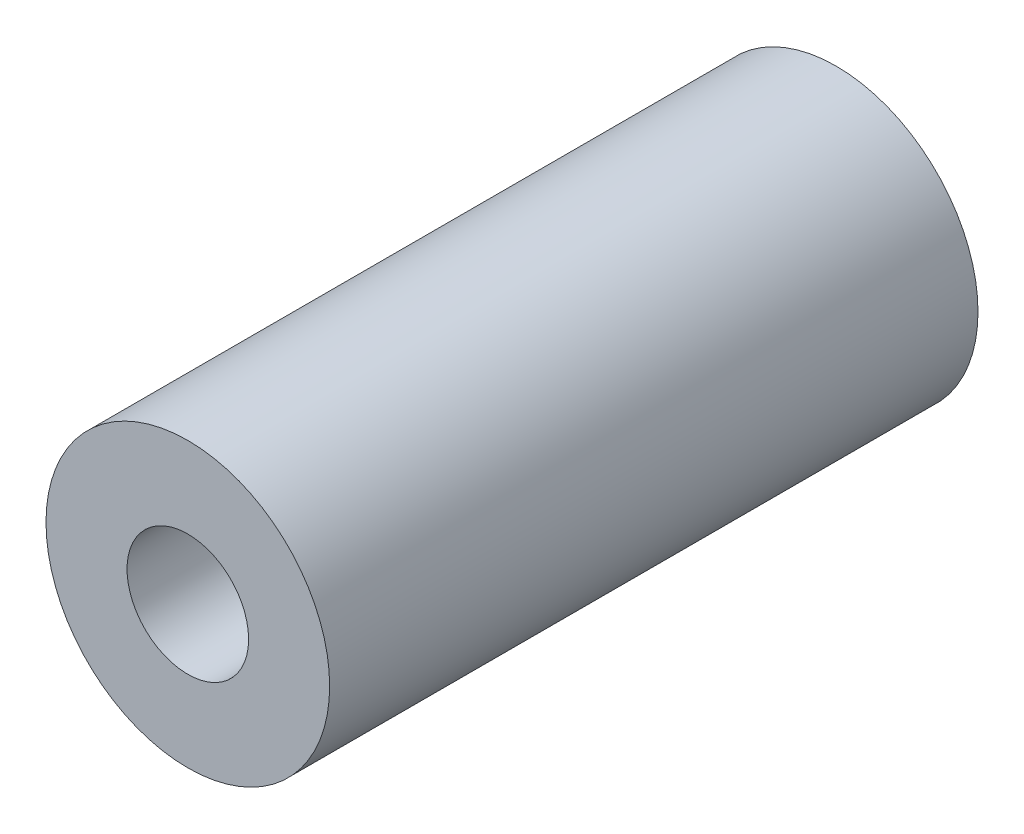
ISO-10303-21;
HEADER;
FILE_DESCRIPTION(('STEP AP214'),'2;1');
FILE_NAME('part.step','',(''),(''),'','','');
FILE_SCHEMA(('AUTOMOTIVE_DESIGN { 1 0 10303 214 1 1 1 1 }'));
ENDSEC;
DATA;
#1=APPLICATION_CONTEXT('core data for automotive mechanical design processes');
#2=APPLICATION_PROTOCOL_DEFINITION('international standard','automotive_design',2000,#1);
#3=PRODUCT_CONTEXT('',#1,'mechanical');
#4=PRODUCT('Part','Part','',(#3));
#5=PRODUCT_RELATED_PRODUCT_CATEGORY('part','',(#4));
#6=PRODUCT_DEFINITION_FORMATION('','',#4);
#7=PRODUCT_DEFINITION_CONTEXT('part definition',#1,'design');
#8=PRODUCT_DEFINITION('design','',#6,#7);
#9=PRODUCT_DEFINITION_SHAPE('','',#8);
#10=(LENGTH_UNIT() NAMED_UNIT(*) SI_UNIT(.MILLI.,.METRE.));
#11=(NAMED_UNIT(*) PLANE_ANGLE_UNIT() SI_UNIT($,.RADIAN.));
#12=(NAMED_UNIT(*) SI_UNIT($,.STERADIAN.) SOLID_ANGLE_UNIT());
#13=UNCERTAINTY_MEASURE_WITH_UNIT(LENGTH_MEASURE(1.E-05),#10,'distance_accuracy_value','');
#14=(GEOMETRIC_REPRESENTATION_CONTEXT(3) GLOBAL_UNCERTAINTY_ASSIGNED_CONTEXT((#13)) GLOBAL_UNIT_ASSIGNED_CONTEXT((#10,
#11,#12)) REPRESENTATION_CONTEXT('',''));
#15=CARTESIAN_POINT('',(0.,0.,0.));
#16=DIRECTION('',(0.,0.,1.));
#17=DIRECTION('',(1.,0.,0.));
#18=AXIS2_PLACEMENT_3D('',#15,#16,#17);
#19=CARTESIAN_POINT('',(0.,0.,50.8));
#20=DIRECTION('',(0.,0.,1.));
#21=DIRECTION('',(1.,0.,0.));
#22=AXIS2_PLACEMENT_3D('',#19,#20,#21);
#23=PLANE('',#22);
#24=CARTESIAN_POINT('',(0.,0.,50.8));
#25=DIRECTION('',(0.,0.,1.));
#26=DIRECTION('',(1.,0.,0.));
#27=AXIS2_PLACEMENT_3D('',#24,#25,#26);
#28=CIRCLE('',#27,11.1125);
#29=CARTESIAN_POINT('',(11.1125,0.,50.8));
#30=VERTEX_POINT('',#29);
#31=EDGE_CURVE('E10',#30,#30,#28,.T.);
#32=ORIENTED_EDGE('',*,*,#31,.T.);
#33=EDGE_LOOP('',(#32));
#34=FACE_BOUND('',#33,.T.);
#35=CARTESIAN_POINT('',(0.,0.,50.8));
#36=DIRECTION('',(0.,0.,1.));
#37=DIRECTION('',(1.,0.,0.));
#38=AXIS2_PLACEMENT_3D('',#35,#36,#37);
#39=CIRCLE('',#38,4.7625);
#40=CARTESIAN_POINT('',(4.7625,0.,50.8));
#41=VERTEX_POINT('',#40);
#42=EDGE_CURVE('E44',#41,#41,#39,.T.);
#43=ORIENTED_EDGE('',*,*,#42,.F.);
#44=EDGE_LOOP('',(#43));
#45=FACE_BOUND('',#44,.T.);
#46=ADVANCED_FACE('F33',(#34,#45),#23,.T.);
#47=CARTESIAN_POINT('',(0.,0.,0.));
#48=DIRECTION('',(0.,0.,1.));
#49=DIRECTION('',(1.,0.,0.));
#50=AXIS2_PLACEMENT_3D('',#47,#48,#49);
#51=PLANE('',#50);
#52=CARTESIAN_POINT('',(0.,0.,0.));
#53=DIRECTION('',(0.,0.,1.));
#54=DIRECTION('',(1.,0.,0.));
#55=AXIS2_PLACEMENT_3D('',#52,#53,#54);
#56=CIRCLE('',#55,11.1125);
#57=CARTESIAN_POINT('',(11.1125,0.,0.));
#58=VERTEX_POINT('',#57);
#59=EDGE_CURVE('E37',#58,#58,#56,.T.);
#60=ORIENTED_EDGE('',*,*,#59,.F.);
#61=EDGE_LOOP('',(#60));
#62=FACE_BOUND('',#61,.T.);
#63=CARTESIAN_POINT('',(0.,0.,0.));
#64=DIRECTION('',(0.,0.,1.));
#65=DIRECTION('',(1.,0.,0.));
#66=AXIS2_PLACEMENT_3D('',#63,#64,#65);
#67=CIRCLE('',#66,4.7625);
#68=CARTESIAN_POINT('',(4.7625,0.,0.));
#69=VERTEX_POINT('',#68);
#70=EDGE_CURVE('E46',#69,#69,#67,.T.);
#71=ORIENTED_EDGE('',*,*,#70,.T.);
#72=EDGE_LOOP('',(#71));
#73=FACE_BOUND('',#72,.T.);
#74=ADVANCED_FACE('F56',(#62,#73),#51,.F.);
#75=CARTESIAN_POINT('',(0.,0.,50.8));
#76=DIRECTION('',(0.,0.,-1.));
#77=DIRECTION('',(-1.,0.,0.));
#78=AXIS2_PLACEMENT_3D('',#75,#76,#77);
#79=CYLINDRICAL_SURFACE('',#78,11.1125);
#80=ORIENTED_EDGE('',*,*,#31,.F.);
#81=EDGE_LOOP('',(#80));
#82=FACE_BOUND('',#81,.T.);
#83=ORIENTED_EDGE('',*,*,#59,.T.);
#84=EDGE_LOOP('',(#83));
#85=FACE_BOUND('',#84,.T.);
#86=ADVANCED_FACE('F35',(#82,#85),#79,.T.);
#87=CARTESIAN_POINT('',(0.,0.,50.8));
#88=DIRECTION('',(0.,0.,-1.));
#89=DIRECTION('',(-1.,0.,0.));
#90=AXIS2_PLACEMENT_3D('',#87,#88,#89);
#91=CYLINDRICAL_SURFACE('',#90,4.7625);
#92=ORIENTED_EDGE('',*,*,#42,.T.);
#93=EDGE_LOOP('',(#92));
#94=FACE_BOUND('',#93,.T.);
#95=ORIENTED_EDGE('',*,*,#70,.F.);
#96=EDGE_LOOP('',(#95));
#97=FACE_BOUND('',#96,.T.);
#98=ADVANCED_FACE('F52',(#94,#97),#91,.F.);
#99=CLOSED_SHELL('',(#46,#74,#86,#98));
#100=MANIFOLD_SOLID_BREP('B2',#99);
#101=ADVANCED_BREP_SHAPE_REPRESENTATION('',(#18,#100),#14);
#102=SHAPE_DEFINITION_REPRESENTATION(#9,#101);
ENDSEC;
END-ISO-10303-21;
